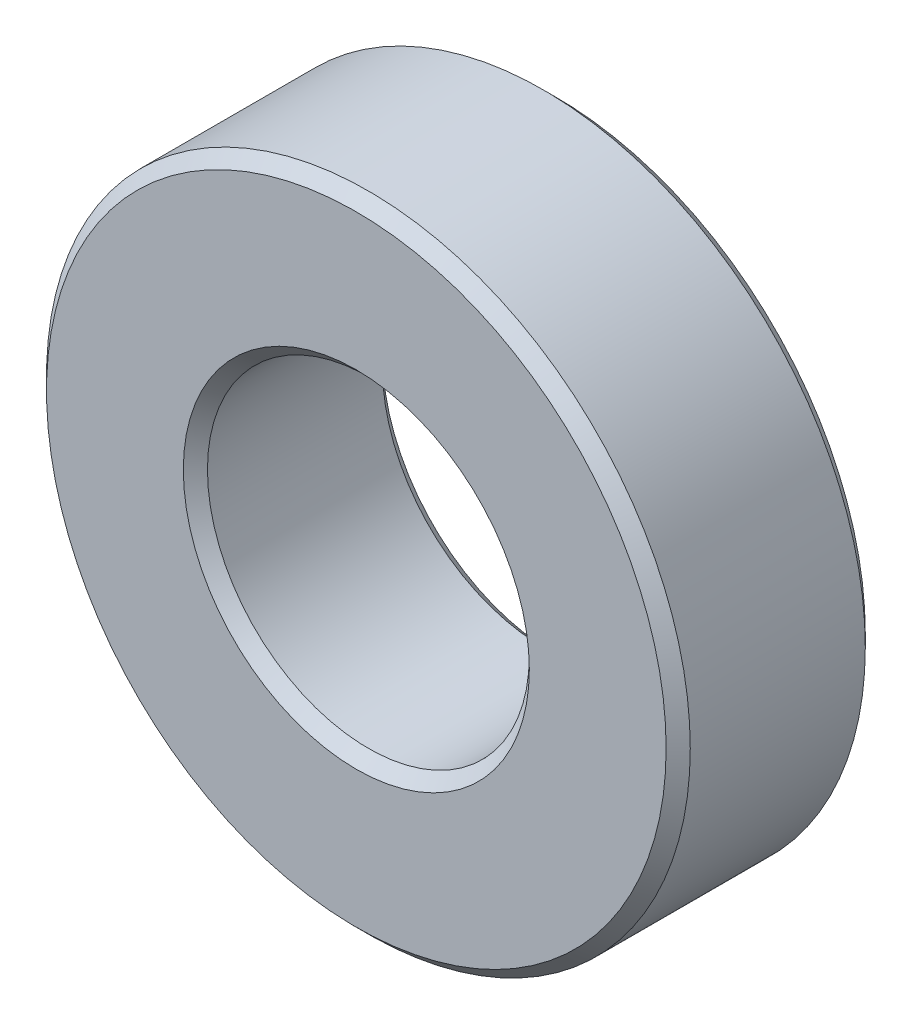
ISO-10303-21;
HEADER;
FILE_DESCRIPTION(('STEP AP214'),'2;1');
FILE_NAME('part.step','',(''),(''),'','','');
FILE_SCHEMA(('AUTOMOTIVE_DESIGN { 1 0 10303 214 1 1 1 1 }'));
ENDSEC;
DATA;
#1=APPLICATION_CONTEXT('core data for automotive mechanical design processes');
#2=APPLICATION_PROTOCOL_DEFINITION('international standard','automotive_design',2000,#1);
#3=PRODUCT_CONTEXT('',#1,'mechanical');
#4=PRODUCT('Part','Part','',(#3));
#5=PRODUCT_RELATED_PRODUCT_CATEGORY('part','',(#4));
#6=PRODUCT_DEFINITION_FORMATION('','',#4);
#7=PRODUCT_DEFINITION_CONTEXT('part definition',#1,'design');
#8=PRODUCT_DEFINITION('design','',#6,#7);
#9=PRODUCT_DEFINITION_SHAPE('','',#8);
#10=(LENGTH_UNIT() NAMED_UNIT(*) SI_UNIT(.MILLI.,.METRE.));
#11=(NAMED_UNIT(*) PLANE_ANGLE_UNIT() SI_UNIT($,.RADIAN.));
#12=(NAMED_UNIT(*) SI_UNIT($,.STERADIAN.) SOLID_ANGLE_UNIT());
#13=UNCERTAINTY_MEASURE_WITH_UNIT(LENGTH_MEASURE(1.E-05),#10,'distance_accuracy_value','');
#14=(GEOMETRIC_REPRESENTATION_CONTEXT(3) GLOBAL_UNCERTAINTY_ASSIGNED_CONTEXT((#13)) GLOBAL_UNIT_ASSIGNED_CONTEXT((#10,
#11,#12)) REPRESENTATION_CONTEXT('',''));
#15=CARTESIAN_POINT('',(0.,0.,0.));
#16=DIRECTION('',(0.,0.,1.));
#17=DIRECTION('',(1.,0.,0.));
#18=AXIS2_PLACEMENT_3D('',#15,#16,#17);
#19=CARTESIAN_POINT('',(0.,0.,4.95));
#20=DIRECTION('',(0.,0.,1.));
#21=DIRECTION('',(1.,0.,0.));
#22=AXIS2_PLACEMENT_3D('',#19,#20,#21);
#23=PLANE('',#22);
#24=CARTESIAN_POINT('',(0.,0.,4.95));
#25=DIRECTION('',(0.,0.,1.));
#26=DIRECTION('',(1.,0.,0.));
#27=AXIS2_PLACEMENT_3D('',#24,#25,#26);
#28=CIRCLE('',#27,4.30000000000001);
#29=CARTESIAN_POINT('',(4.30000000000001,0.,4.95));
#30=VERTEX_POINT('',#29);
#31=EDGE_CURVE('E10',#30,#30,#28,.F.);
#32=ORIENTED_EDGE('',*,*,#31,.T.);
#33=EDGE_LOOP('',(#32));
#34=FACE_BOUND('',#33,.T.);
#35=CARTESIAN_POINT('',(0.,0.,4.95));
#36=DIRECTION('',(0.,0.,1.));
#37=DIRECTION('',(1.,0.,0.));
#38=AXIS2_PLACEMENT_3D('',#35,#36,#37);
#39=CIRCLE('',#38,7.70000000000001);
#40=CARTESIAN_POINT('',(7.70000000000001,0.,4.95));
#41=VERTEX_POINT('',#40);
#42=EDGE_CURVE('E39',#41,#41,#39,.T.);
#43=ORIENTED_EDGE('',*,*,#42,.T.);
#44=EDGE_LOOP('',(#43));
#45=FACE_BOUND('',#44,.T.);
#46=ADVANCED_FACE('F32',(#34,#45),#23,.T.);
#47=CARTESIAN_POINT('',(0.,0.,0.));
#48=DIRECTION('',(0.,0.,1.));
#49=DIRECTION('',(1.,0.,0.));
#50=AXIS2_PLACEMENT_3D('',#47,#48,#49);
#51=PLANE('',#50);
#52=CARTESIAN_POINT('',(0.,0.,0.));
#53=DIRECTION('',(0.,0.,1.));
#54=DIRECTION('',(1.,0.,0.));
#55=AXIS2_PLACEMENT_3D('',#52,#53,#54);
#56=CIRCLE('',#55,4.29999999999999);
#57=CARTESIAN_POINT('',(4.29999999999999,0.,0.));
#58=VERTEX_POINT('',#57);
#59=EDGE_CURVE('E58',#58,#58,#56,.T.);
#60=ORIENTED_EDGE('',*,*,#59,.T.);
#61=EDGE_LOOP('',(#60));
#62=FACE_BOUND('',#61,.T.);
#63=CARTESIAN_POINT('',(0.,0.,0.));
#64=DIRECTION('',(0.,0.,1.));
#65=DIRECTION('',(1.,0.,0.));
#66=AXIS2_PLACEMENT_3D('',#63,#64,#65);
#67=CIRCLE('',#66,7.69999999999999);
#68=CARTESIAN_POINT('',(7.69999999999999,0.,0.));
#69=VERTEX_POINT('',#68);
#70=EDGE_CURVE('E61',#69,#69,#67,.F.);
#71=ORIENTED_EDGE('',*,*,#70,.T.);
#72=EDGE_LOOP('',(#71));
#73=FACE_BOUND('',#72,.T.);
#74=ADVANCED_FACE('F65',(#62,#73),#51,.F.);
#75=CARTESIAN_POINT('',(0.,0.,4.95));
#76=DIRECTION('',(0.,0.,-1.));
#77=DIRECTION('',(-1.,0.,0.));
#78=AXIS2_PLACEMENT_3D('',#75,#76,#77);
#79=CYLINDRICAL_SURFACE('',#78,8.);
#80=CARTESIAN_POINT('',(0.,0.,0.300000000000009));
#81=DIRECTION('',(0.,0.,1.));
#82=DIRECTION('',(1.,0.,0.));
#83=AXIS2_PLACEMENT_3D('',#80,#81,#82);
#84=CIRCLE('',#83,8.);
#85=CARTESIAN_POINT('',(8.,0.,0.300000000000009));
#86=VERTEX_POINT('',#85);
#87=EDGE_CURVE('E43',#86,#86,#84,.T.);
#88=ORIENTED_EDGE('',*,*,#87,.T.);
#89=EDGE_LOOP('',(#88));
#90=FACE_BOUND('',#89,.T.);
#91=CARTESIAN_POINT('',(0.,0.,4.65000000000001));
#92=DIRECTION('',(0.,0.,1.));
#93=DIRECTION('',(1.,0.,0.));
#94=AXIS2_PLACEMENT_3D('',#91,#92,#93);
#95=CIRCLE('',#94,8.);
#96=CARTESIAN_POINT('',(8.,0.,4.65000000000001));
#97=VERTEX_POINT('',#96);
#98=EDGE_CURVE('E47',#97,#97,#95,.F.);
#99=ORIENTED_EDGE('',*,*,#98,.T.);
#100=EDGE_LOOP('',(#99));
#101=FACE_BOUND('',#100,.T.);
#102=ADVANCED_FACE('F75',(#90,#101),#79,.T.);
#103=CARTESIAN_POINT('',(0.,0.,4.95));
#104=DIRECTION('',(0.,0.,-1.));
#105=DIRECTION('',(-1.,0.,0.));
#106=AXIS2_PLACEMENT_3D('',#103,#104,#105);
#107=CYLINDRICAL_SURFACE('',#106,4.);
#108=CARTESIAN_POINT('',(0.,0.,0.299999999999996));
#109=DIRECTION('',(0.,0.,1.));
#110=DIRECTION('',(1.,0.,0.));
#111=AXIS2_PLACEMENT_3D('',#108,#109,#110);
#112=CIRCLE('',#111,4.);
#113=CARTESIAN_POINT('',(4.,0.,0.299999999999996));
#114=VERTEX_POINT('',#113);
#115=EDGE_CURVE('E52',#114,#114,#112,.F.);
#116=ORIENTED_EDGE('',*,*,#115,.T.);
#117=EDGE_LOOP('',(#116));
#118=FACE_BOUND('',#117,.T.);
#119=CARTESIAN_POINT('',(0.,0.,4.64999999999999));
#120=DIRECTION('',(0.,0.,1.));
#121=DIRECTION('',(1.,0.,0.));
#122=AXIS2_PLACEMENT_3D('',#119,#120,#121);
#123=CIRCLE('',#122,4.);
#124=CARTESIAN_POINT('',(4.,0.,4.64999999999999));
#125=VERTEX_POINT('',#124);
#126=EDGE_CURVE('E55',#125,#125,#123,.T.);
#127=ORIENTED_EDGE('',*,*,#126,.T.);
#128=EDGE_LOOP('',(#127));
#129=FACE_BOUND('',#128,.T.);
#130=ADVANCED_FACE('F78',(#118,#129),#107,.F.);
#131=CARTESIAN_POINT('',(0.,0.,0.));
#132=DIRECTION('',(0.,0.,-1.));
#133=DIRECTION('',(-1.,0.,0.));
#134=AXIS2_PLACEMENT_3D('',#131,#132,#133);
#135=CONICAL_SURFACE('',#134,4.29999999999999,0.785398163397443);
#136=ORIENTED_EDGE('',*,*,#115,.F.);
#137=EDGE_LOOP('',(#136));
#138=FACE_BOUND('',#137,.T.);
#139=ORIENTED_EDGE('',*,*,#59,.F.);
#140=EDGE_LOOP('',(#139));
#141=FACE_BOUND('',#140,.T.);
#142=ADVANCED_FACE('F71',(#138,#141),#135,.F.);
#143=CARTESIAN_POINT('',(0.,0.,0.300000000000009));
#144=DIRECTION('',(0.,0.,1.));
#145=DIRECTION('',(1.,0.,0.));
#146=AXIS2_PLACEMENT_3D('',#143,#144,#145);
#147=CONICAL_SURFACE('',#146,8.,0.785398163397448);
#148=ORIENTED_EDGE('',*,*,#70,.F.);
#149=EDGE_LOOP('',(#148));
#150=FACE_BOUND('',#149,.T.);
#151=ORIENTED_EDGE('',*,*,#87,.F.);
#152=EDGE_LOOP('',(#151));
#153=FACE_BOUND('',#152,.T.);
#154=ADVANCED_FACE('F67',(#150,#153),#147,.T.);
#155=CARTESIAN_POINT('',(0.,0.,4.64999999999999));
#156=DIRECTION('',(0.,0.,1.));
#157=DIRECTION('',(1.,0.,0.));
#158=AXIS2_PLACEMENT_3D('',#155,#156,#157);
#159=CONICAL_SURFACE('',#158,4.,0.785398163397445);
#160=ORIENTED_EDGE('',*,*,#31,.F.);
#161=EDGE_LOOP('',(#160));
#162=FACE_BOUND('',#161,.T.);
#163=ORIENTED_EDGE('',*,*,#126,.F.);
#164=EDGE_LOOP('',(#163));
#165=FACE_BOUND('',#164,.T.);
#166=ADVANCED_FACE('F70',(#162,#165),#159,.F.);
#167=CARTESIAN_POINT('',(0.,0.,4.95));
#168=DIRECTION('',(0.,0.,-1.));
#169=DIRECTION('',(-1.,0.,0.));
#170=AXIS2_PLACEMENT_3D('',#167,#168,#169);
#171=CONICAL_SURFACE('',#170,7.70000000000001,0.785398163397448);
#172=ORIENTED_EDGE('',*,*,#98,.F.);
#173=EDGE_LOOP('',(#172));
#174=FACE_BOUND('',#173,.T.);
#175=ORIENTED_EDGE('',*,*,#42,.F.);
#176=EDGE_LOOP('',(#175));
#177=FACE_BOUND('',#176,.T.);
#178=ADVANCED_FACE('F34',(#174,#177),#171,.T.);
#179=CLOSED_SHELL('',(#46,#74,#102,#130,#142,#154,#166,#178));
#180=MANIFOLD_SOLID_BREP('B2',#179);
#181=ADVANCED_BREP_SHAPE_REPRESENTATION('',(#18,#180),#14);
#182=SHAPE_DEFINITION_REPRESENTATION(#9,#181);
ENDSEC;
END-ISO-10303-21;
